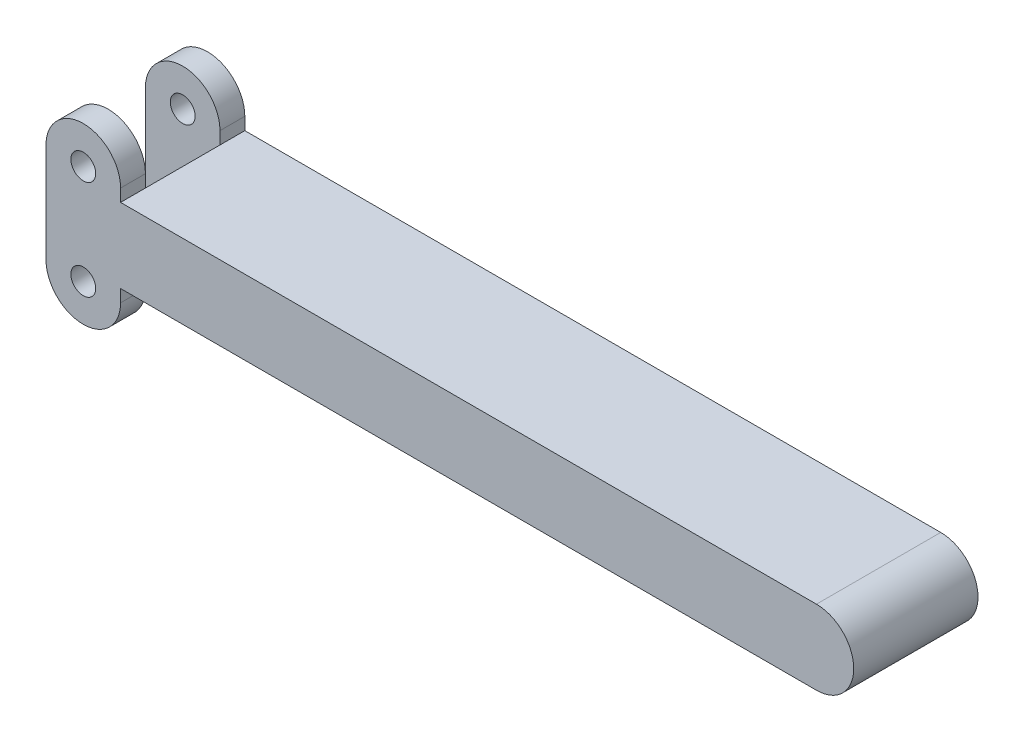
ISO-10303-21;
HEADER;
FILE_DESCRIPTION(('STEP AP214'),'2;1');
FILE_NAME('part.step','',(''),(''),'','','');
FILE_SCHEMA(('AUTOMOTIVE_DESIGN { 1 0 10303 214 1 1 1 1 }'));
ENDSEC;
DATA;
#1=APPLICATION_CONTEXT('core data for automotive mechanical design processes');
#2=APPLICATION_PROTOCOL_DEFINITION('international standard','automotive_design',2000,#1);
#3=PRODUCT_CONTEXT('',#1,'mechanical');
#4=PRODUCT('Part','Part','',(#3));
#5=PRODUCT_RELATED_PRODUCT_CATEGORY('part','',(#4));
#6=PRODUCT_DEFINITION_FORMATION('','',#4);
#7=PRODUCT_DEFINITION_CONTEXT('part definition',#1,'design');
#8=PRODUCT_DEFINITION('design','',#6,#7);
#9=PRODUCT_DEFINITION_SHAPE('','',#8);
#10=(LENGTH_UNIT() NAMED_UNIT(*) SI_UNIT(.MILLI.,.METRE.));
#11=(NAMED_UNIT(*) PLANE_ANGLE_UNIT() SI_UNIT($,.RADIAN.));
#12=(NAMED_UNIT(*) SI_UNIT($,.STERADIAN.) SOLID_ANGLE_UNIT());
#13=UNCERTAINTY_MEASURE_WITH_UNIT(LENGTH_MEASURE(1.E-05),#10,'distance_accuracy_value','');
#14=(GEOMETRIC_REPRESENTATION_CONTEXT(3) GLOBAL_UNCERTAINTY_ASSIGNED_CONTEXT((#13)) GLOBAL_UNIT_ASSIGNED_CONTEXT((#10,
#11,#12)) REPRESENTATION_CONTEXT('',''));
#15=CARTESIAN_POINT('',(0.,0.,0.));
#16=DIRECTION('',(0.,0.,1.));
#17=DIRECTION('',(1.,0.,0.));
#18=AXIS2_PLACEMENT_3D('',#15,#16,#17);
#19=CARTESIAN_POINT('',(9.525,0.,31.75));
#20=DIRECTION('',(-1.,0.,0.));
#21=DIRECTION('',(0.,-1.,0.));
#22=AXIS2_PLACEMENT_3D('',#19,#20,#21);
#23=PLANE('',#22);
#24=DIRECTION('',(0.,-1.,0.));
#25=VECTOR('',#24,1.);
#26=CARTESIAN_POINT('',(9.525,0.,25.4));
#27=LINE('',#26,#25);
#28=CARTESIAN_POINT('',(9.525,25.4,25.4));
#29=VERTEX_POINT('',#28);
#30=CARTESIAN_POINT('',(9.525,22.225,25.4));
#31=VERTEX_POINT('',#30);
#32=EDGE_CURVE('E188',#29,#31,#27,.T.);
#33=ORIENTED_EDGE('',*,*,#32,.F.);
#34=DIRECTION('',(0.,0.,-1.));
#35=VECTOR('',#34,1.);
#36=CARTESIAN_POINT('',(9.525,25.4,31.75));
#37=LINE('',#36,#35);
#38=CARTESIAN_POINT('',(9.525,25.4,31.75));
#39=VERTEX_POINT('',#38);
#40=EDGE_CURVE('E213',#39,#29,#37,.T.);
#41=ORIENTED_EDGE('',*,*,#40,.F.);
#42=DIRECTION('',(0.,1.,0.));
#43=VECTOR('',#42,1.);
#44=CARTESIAN_POINT('',(9.525,0.,31.75));
#45=LINE('',#44,#43);
#46=CARTESIAN_POINT('',(9.525,22.225,31.75));
#47=VERTEX_POINT('',#46);
#48=EDGE_CURVE('E141',#47,#39,#45,.T.);
#49=ORIENTED_EDGE('',*,*,#48,.F.);
#50=DIRECTION('',(0.,0.,-1.));
#51=VECTOR('',#50,1.);
#52=CARTESIAN_POINT('',(9.525,22.225,31.75));
#53=LINE('',#52,#51);
#54=EDGE_CURVE('E44',#47,#31,#53,.T.);
#55=ORIENTED_EDGE('',*,*,#54,.T.);
#56=EDGE_LOOP('',(#33,#41,#49,#55));
#57=FACE_BOUND('',#56,.T.);
#58=ADVANCED_FACE('F35',(#57),#23,.F.);
#59=CARTESIAN_POINT('',(0.,25.4,31.75));
#60=DIRECTION('',(0.,0.,-1.));
#61=DIRECTION('',(-1.,0.,0.));
#62=AXIS2_PLACEMENT_3D('',#59,#60,#61);
#63=CYLINDRICAL_SURFACE('',#62,9.525);
#64=CARTESIAN_POINT('',(0.,25.4,25.4));
#65=DIRECTION('',(0.,0.,-1.));
#66=DIRECTION('',(0.,1.,0.));
#67=AXIS2_PLACEMENT_3D('',#64,#65,#66);
#68=CIRCLE('',#67,9.525);
#69=CARTESIAN_POINT('',(-9.525,25.4,25.4));
#70=VERTEX_POINT('',#69);
#71=EDGE_CURVE('E161',#70,#29,#68,.T.);
#72=ORIENTED_EDGE('',*,*,#71,.F.);
#73=DIRECTION('',(0.,0.,-1.));
#74=VECTOR('',#73,1.);
#75=CARTESIAN_POINT('',(-9.52500000000001,25.4,31.75));
#76=LINE('',#75,#74);
#77=CARTESIAN_POINT('',(-9.52500000000001,25.4,31.75));
#78=VERTEX_POINT('',#77);
#79=EDGE_CURVE('E259',#78,#70,#76,.T.);
#80=ORIENTED_EDGE('',*,*,#79,.F.);
#81=CARTESIAN_POINT('',(0.,25.4,31.75));
#82=DIRECTION('',(0.,0.,1.));
#83=DIRECTION('',(1.,0.,0.));
#84=AXIS2_PLACEMENT_3D('',#81,#82,#83);
#85=CIRCLE('',#84,9.525);
#86=EDGE_CURVE('E146',#39,#78,#85,.T.);
#87=ORIENTED_EDGE('',*,*,#86,.F.);
#88=ORIENTED_EDGE('',*,*,#40,.T.);
#89=EDGE_LOOP('',(#72,#80,#87,#88));
#90=FACE_BOUND('',#89,.T.);
#91=ADVANCED_FACE('F315',(#90),#63,.T.);
#92=CARTESIAN_POINT('',(0.,25.4,6.35));
#93=DIRECTION('',(0.,0.,-1.));
#94=DIRECTION('',(0.,1.,0.));
#95=AXIS2_PLACEMENT_3D('',#92,#93,#94);
#96=CIRCLE('',#95,9.525);
#97=CARTESIAN_POINT('',(-9.525,25.4,6.35));
#98=VERTEX_POINT('',#97);
#99=CARTESIAN_POINT('',(9.525,25.4,6.35));
#100=VERTEX_POINT('',#99);
#101=EDGE_CURVE('E168',#98,#100,#96,.T.);
#102=ORIENTED_EDGE('',*,*,#101,.T.);
#103=CARTESIAN_POINT('',(9.525,25.4,0.));
#104=VERTEX_POINT('',#103);
#105=EDGE_CURVE('E227',#100,#104,#37,.T.);
#106=ORIENTED_EDGE('',*,*,#105,.T.);
#107=CARTESIAN_POINT('',(0.,25.4,0.));
#108=DIRECTION('',(0.,0.,1.));
#109=DIRECTION('',(1.,0.,0.));
#110=AXIS2_PLACEMENT_3D('',#107,#108,#109);
#111=CIRCLE('',#110,9.525);
#112=CARTESIAN_POINT('',(-9.52500000000001,25.4,0.));
#113=VERTEX_POINT('',#112);
#114=EDGE_CURVE('E271',#104,#113,#111,.T.);
#115=ORIENTED_EDGE('',*,*,#114,.T.);
#116=EDGE_CURVE('E258',#98,#113,#76,.T.);
#117=ORIENTED_EDGE('',*,*,#116,.F.);
#118=EDGE_LOOP('',(#102,#106,#115,#117));
#119=FACE_BOUND('',#118,.T.);
#120=ADVANCED_FACE('F272',(#119),#63,.T.);
#121=CARTESIAN_POINT('',(-9.525,0.,31.75));
#122=DIRECTION('',(-1.,0.,0.));
#123=DIRECTION('',(0.,-1.,0.));
#124=AXIS2_PLACEMENT_3D('',#121,#122,#123);
#125=PLANE('',#124);
#126=ORIENTED_EDGE('',*,*,#79,.T.);
#127=DIRECTION('',(0.,-1.,0.));
#128=VECTOR('',#127,1.);
#129=CARTESIAN_POINT('',(-9.525,0.,25.4));
#130=LINE('',#129,#128);
#131=CARTESIAN_POINT('',(-9.525,0.,25.4));
#132=VERTEX_POINT('',#131);
#133=EDGE_CURVE('E182',#70,#132,#130,.T.);
#134=ORIENTED_EDGE('',*,*,#133,.T.);
#135=DIRECTION('',(0.,0.,-1.));
#136=VECTOR('',#135,1.);
#137=CARTESIAN_POINT('',(-9.525,0.,31.75));
#138=LINE('',#137,#136);
#139=CARTESIAN_POINT('',(-9.525,0.,31.75));
#140=VERTEX_POINT('',#139);
#141=EDGE_CURVE('E257',#140,#132,#138,.T.);
#142=ORIENTED_EDGE('',*,*,#141,.F.);
#143=DIRECTION('',(0.,1.,0.));
#144=VECTOR('',#143,1.);
#145=CARTESIAN_POINT('',(-9.525,0.,31.75));
#146=LINE('',#145,#144);
#147=EDGE_CURVE('E122',#140,#78,#146,.T.);
#148=ORIENTED_EDGE('',*,*,#147,.T.);
#149=EDGE_LOOP('',(#126,#134,#142,#148));
#150=FACE_BOUND('',#149,.T.);
#151=ADVANCED_FACE('F341',(#150),#125,.T.);
#152=CARTESIAN_POINT('',(0.,0.,31.75));
#153=DIRECTION('',(0.,0.,-1.));
#154=DIRECTION('',(-1.,0.,0.));
#155=AXIS2_PLACEMENT_3D('',#152,#153,#154);
#156=CYLINDRICAL_SURFACE('',#155,9.525);
#157=CARTESIAN_POINT('',(0.,0.,25.4));
#158=DIRECTION('',(0.,0.,-1.));
#159=DIRECTION('',(0.,1.,0.));
#160=AXIS2_PLACEMENT_3D('',#157,#158,#159);
#161=CIRCLE('',#160,9.525);
#162=CARTESIAN_POINT('',(9.525,0.,25.4));
#163=VERTEX_POINT('',#162);
#164=EDGE_CURVE('E131',#163,#132,#161,.T.);
#165=ORIENTED_EDGE('',*,*,#164,.F.);
#166=DIRECTION('',(0.,0.,-1.));
#167=VECTOR('',#166,1.);
#168=CARTESIAN_POINT('',(9.525,0.,31.75));
#169=LINE('',#168,#167);
#170=CARTESIAN_POINT('',(9.525,0.,31.75));
#171=VERTEX_POINT('',#170);
#172=EDGE_CURVE('E128',#171,#163,#169,.T.);
#173=ORIENTED_EDGE('',*,*,#172,.F.);
#174=CARTESIAN_POINT('',(0.,0.,31.75));
#175=DIRECTION('',(0.,0.,1.));
#176=DIRECTION('',(1.,0.,0.));
#177=AXIS2_PLACEMENT_3D('',#174,#175,#176);
#178=CIRCLE('',#177,9.525);
#179=EDGE_CURVE('E114',#140,#171,#178,.T.);
#180=ORIENTED_EDGE('',*,*,#179,.F.);
#181=ORIENTED_EDGE('',*,*,#141,.T.);
#182=EDGE_LOOP('',(#165,#173,#180,#181));
#183=FACE_BOUND('',#182,.T.);
#184=ADVANCED_FACE('F129',(#183),#156,.T.);
#185=CARTESIAN_POINT('',(9.525,3.175,25.4));
#186=VERTEX_POINT('',#185);
#187=EDGE_CURVE('E181',#186,#163,#27,.T.);
#188=ORIENTED_EDGE('',*,*,#187,.F.);
#189=DIRECTION('',(0.,0.,-1.));
#190=VECTOR('',#189,1.);
#191=CARTESIAN_POINT('',(9.525,3.175,31.75));
#192=LINE('',#191,#190);
#193=CARTESIAN_POINT('',(9.525,3.175,31.75));
#194=VERTEX_POINT('',#193);
#195=EDGE_CURVE('E139',#194,#186,#192,.T.);
#196=ORIENTED_EDGE('',*,*,#195,.F.);
#197=EDGE_CURVE('E119',#171,#194,#45,.T.);
#198=ORIENTED_EDGE('',*,*,#197,.F.);
#199=ORIENTED_EDGE('',*,*,#172,.T.);
#200=EDGE_LOOP('',(#188,#196,#198,#199));
#201=FACE_BOUND('',#200,.T.);
#202=ADVANCED_FACE('F137',(#201),#23,.F.);
#203=CARTESIAN_POINT('',(0.,0.,31.75));
#204=DIRECTION('',(0.,0.,-1.));
#205=DIRECTION('',(-1.,0.,0.));
#206=AXIS2_PLACEMENT_3D('',#203,#204,#205);
#207=CYLINDRICAL_SURFACE('',#206,3.175);
#208=CARTESIAN_POINT('',(0.,0.,31.75));
#209=DIRECTION('',(0.,0.,1.));
#210=DIRECTION('',(1.,0.,0.));
#211=AXIS2_PLACEMENT_3D('',#208,#209,#210);
#212=CIRCLE('',#211,3.175);
#213=CARTESIAN_POINT('',(3.175,0.,31.75));
#214=VERTEX_POINT('',#213);
#215=EDGE_CURVE('E142',#214,#214,#212,.T.);
#216=ORIENTED_EDGE('',*,*,#215,.T.);
#217=EDGE_LOOP('',(#216));
#218=FACE_BOUND('',#217,.T.);
#219=CARTESIAN_POINT('',(0.,0.,25.4));
#220=DIRECTION('',(0.,0.,-1.));
#221=DIRECTION('',(0.,1.,0.));
#222=AXIS2_PLACEMENT_3D('',#219,#220,#221);
#223=CIRCLE('',#222,3.175);
#224=CARTESIAN_POINT('',(0.,3.175,25.4));
#225=VERTEX_POINT('',#224);
#226=EDGE_CURVE('E165',#225,#225,#223,.T.);
#227=ORIENTED_EDGE('',*,*,#226,.T.);
#228=EDGE_LOOP('',(#227));
#229=FACE_BOUND('',#228,.T.);
#230=ADVANCED_FACE('F312',(#218,#229),#207,.F.);
#231=CARTESIAN_POINT('',(0.,25.4,31.75));
#232=DIRECTION('',(0.,0.,-1.));
#233=DIRECTION('',(-1.,0.,0.));
#234=AXIS2_PLACEMENT_3D('',#231,#232,#233);
#235=CYLINDRICAL_SURFACE('',#234,3.175);
#236=CARTESIAN_POINT('',(0.,25.4,31.75));
#237=DIRECTION('',(0.,0.,1.));
#238=DIRECTION('',(1.,0.,0.));
#239=AXIS2_PLACEMENT_3D('',#236,#237,#238);
#240=CIRCLE('',#239,3.175);
#241=CARTESIAN_POINT('',(3.17499999999999,25.4,31.75));
#242=VERTEX_POINT('',#241);
#243=EDGE_CURVE('E353',#242,#242,#240,.T.);
#244=ORIENTED_EDGE('',*,*,#243,.T.);
#245=EDGE_LOOP('',(#244));
#246=FACE_BOUND('',#245,.T.);
#247=CARTESIAN_POINT('',(0.,25.4,25.4));
#248=DIRECTION('',(0.,0.,-1.));
#249=DIRECTION('',(0.,1.,0.));
#250=AXIS2_PLACEMENT_3D('',#247,#248,#249);
#251=CIRCLE('',#250,3.175);
#252=CARTESIAN_POINT('',(0.,28.575,25.4));
#253=VERTEX_POINT('',#252);
#254=EDGE_CURVE('E39',#253,#253,#251,.T.);
#255=ORIENTED_EDGE('',*,*,#254,.T.);
#256=EDGE_LOOP('',(#255));
#257=FACE_BOUND('',#256,.T.);
#258=ADVANCED_FACE('F301',(#246,#257),#235,.F.);
#259=CARTESIAN_POINT('',(187.325,12.7,31.75));
#260=DIRECTION('',(0.,0.,-1.));
#261=DIRECTION('',(-1.,0.,0.));
#262=AXIS2_PLACEMENT_3D('',#259,#260,#261);
#263=CYLINDRICAL_SURFACE('',#262,9.525);
#264=CARTESIAN_POINT('',(187.325,12.7,0.));
#265=DIRECTION('',(0.,0.,1.));
#266=DIRECTION('',(1.,0.,0.));
#267=AXIS2_PLACEMENT_3D('',#264,#265,#266);
#268=CIRCLE('',#267,9.525);
#269=CARTESIAN_POINT('',(187.325,22.225,0.));
#270=VERTEX_POINT('',#269);
#271=CARTESIAN_POINT('',(187.325,3.175,0.));
#272=VERTEX_POINT('',#271);
#273=EDGE_CURVE('E160',#270,#272,#268,.F.);
#274=ORIENTED_EDGE('',*,*,#273,.F.);
#275=DIRECTION('',(0.,0.,-1.));
#276=VECTOR('',#275,1.);
#277=CARTESIAN_POINT('',(187.325,22.225,31.75));
#278=LINE('',#277,#276);
#279=CARTESIAN_POINT('',(187.325,22.225,31.75));
#280=VERTEX_POINT('',#279);
#281=EDGE_CURVE('E11',#280,#270,#278,.T.);
#282=ORIENTED_EDGE('',*,*,#281,.F.);
#283=CARTESIAN_POINT('',(187.325,12.7,31.75));
#284=DIRECTION('',(0.,0.,1.));
#285=DIRECTION('',(1.,0.,0.));
#286=AXIS2_PLACEMENT_3D('',#283,#284,#285);
#287=CIRCLE('',#286,9.525);
#288=CARTESIAN_POINT('',(187.325,3.175,31.75));
#289=VERTEX_POINT('',#288);
#290=EDGE_CURVE('E152',#280,#289,#287,.F.);
#291=ORIENTED_EDGE('',*,*,#290,.T.);
#292=DIRECTION('',(0.,0.,-1.));
#293=VECTOR('',#292,1.);
#294=CARTESIAN_POINT('',(187.325,3.175,31.75));
#295=LINE('',#294,#293);
#296=EDGE_CURVE('E93',#289,#272,#295,.T.);
#297=ORIENTED_EDGE('',*,*,#296,.T.);
#298=EDGE_LOOP('',(#274,#282,#291,#297));
#299=FACE_BOUND('',#298,.T.);
#300=ADVANCED_FACE('F37',(#299),#263,.T.);
#301=CARTESIAN_POINT('',(0.,22.225,31.75));
#302=DIRECTION('',(0.,1.,0.));
#303=DIRECTION('',(0.,0.,1.));
#304=AXIS2_PLACEMENT_3D('',#301,#302,#303);
#305=PLANE('',#304);
#306=DIRECTION('',(1.,0.,0.));
#307=VECTOR('',#306,1.);
#308=CARTESIAN_POINT('',(0.,22.225,0.));
#309=LINE('',#308,#307);
#310=CARTESIAN_POINT('',(9.525,22.225,0.));
#311=VERTEX_POINT('',#310);
#312=EDGE_CURVE('E349',#311,#270,#309,.T.);
#313=ORIENTED_EDGE('',*,*,#312,.F.);
#314=CARTESIAN_POINT('',(9.525,22.225,6.35));
#315=VERTEX_POINT('',#314);
#316=EDGE_CURVE('E211',#315,#311,#53,.T.);
#317=ORIENTED_EDGE('',*,*,#316,.F.);
#318=DIRECTION('',(0.,0.,1.));
#319=VECTOR('',#318,1.);
#320=CARTESIAN_POINT('',(9.525,22.225,31.75));
#321=LINE('',#320,#319);
#322=EDGE_CURVE('E157',#315,#31,#321,.T.);
#323=ORIENTED_EDGE('',*,*,#322,.T.);
#324=ORIENTED_EDGE('',*,*,#54,.F.);
#325=DIRECTION('',(1.,0.,0.));
#326=VECTOR('',#325,1.);
#327=CARTESIAN_POINT('',(0.,22.225,31.75));
#328=LINE('',#327,#326);
#329=EDGE_CURVE('E147',#47,#280,#328,.T.);
#330=ORIENTED_EDGE('',*,*,#329,.T.);
#331=ORIENTED_EDGE('',*,*,#281,.T.);
#332=EDGE_LOOP('',(#313,#317,#323,#324,#330,#331));
#333=FACE_BOUND('',#332,.T.);
#334=ADVANCED_FACE('F209',(#333),#305,.T.);
#335=ORIENTED_EDGE('',*,*,#105,.F.);
#336=DIRECTION('',(0.,-1.,0.));
#337=VECTOR('',#336,1.);
#338=CARTESIAN_POINT('',(9.525,0.,6.35));
#339=LINE('',#338,#337);
#340=EDGE_CURVE('E189',#100,#315,#339,.T.);
#341=ORIENTED_EDGE('',*,*,#340,.T.);
#342=ORIENTED_EDGE('',*,*,#316,.T.);
#343=DIRECTION('',(0.,1.,0.));
#344=VECTOR('',#343,1.);
#345=CARTESIAN_POINT('',(9.525,0.,0.));
#346=LINE('',#345,#344);
#347=EDGE_CURVE('E274',#311,#104,#346,.T.);
#348=ORIENTED_EDGE('',*,*,#347,.T.);
#349=EDGE_LOOP('',(#335,#341,#342,#348));
#350=FACE_BOUND('',#349,.T.);
#351=ADVANCED_FACE('F223',(#350),#23,.F.);
#352=DIRECTION('',(0.,-1.,0.));
#353=VECTOR('',#352,1.);
#354=CARTESIAN_POINT('',(-9.525,0.,6.35));
#355=LINE('',#354,#353);
#356=CARTESIAN_POINT('',(-9.525,0.,6.35));
#357=VERTEX_POINT('',#356);
#358=EDGE_CURVE('E178',#98,#357,#355,.T.);
#359=ORIENTED_EDGE('',*,*,#358,.F.);
#360=ORIENTED_EDGE('',*,*,#116,.T.);
#361=DIRECTION('',(0.,1.,0.));
#362=VECTOR('',#361,1.);
#363=CARTESIAN_POINT('',(-9.525,0.,0.));
#364=LINE('',#363,#362);
#365=CARTESIAN_POINT('',(-9.525,0.,0.));
#366=VERTEX_POINT('',#365);
#367=EDGE_CURVE('E269',#366,#113,#364,.T.);
#368=ORIENTED_EDGE('',*,*,#367,.F.);
#369=EDGE_CURVE('E134',#357,#366,#138,.T.);
#370=ORIENTED_EDGE('',*,*,#369,.F.);
#371=EDGE_LOOP('',(#359,#360,#368,#370));
#372=FACE_BOUND('',#371,.T.);
#373=ADVANCED_FACE('F266',(#372),#125,.T.);
#374=CARTESIAN_POINT('',(9.525,0.,6.35));
#375=VERTEX_POINT('',#374);
#376=CARTESIAN_POINT('',(9.525,0.,0.));
#377=VERTEX_POINT('',#376);
#378=EDGE_CURVE('E135',#375,#377,#169,.T.);
#379=ORIENTED_EDGE('',*,*,#378,.F.);
#380=CARTESIAN_POINT('',(0.,0.,6.35));
#381=DIRECTION('',(0.,0.,-1.));
#382=DIRECTION('',(0.,1.,0.));
#383=AXIS2_PLACEMENT_3D('',#380,#381,#382);
#384=CIRCLE('',#383,9.525);
#385=EDGE_CURVE('E171',#375,#357,#384,.T.);
#386=ORIENTED_EDGE('',*,*,#385,.T.);
#387=ORIENTED_EDGE('',*,*,#369,.T.);
#388=CARTESIAN_POINT('',(0.,0.,0.));
#389=DIRECTION('',(0.,0.,1.));
#390=DIRECTION('',(1.,0.,0.));
#391=AXIS2_PLACEMENT_3D('',#388,#389,#390);
#392=CIRCLE('',#391,9.525);
#393=EDGE_CURVE('E282',#366,#377,#392,.T.);
#394=ORIENTED_EDGE('',*,*,#393,.T.);
#395=EDGE_LOOP('',(#379,#386,#387,#394));
#396=FACE_BOUND('',#395,.T.);
#397=ADVANCED_FACE('F326',(#396),#156,.T.);
#398=CARTESIAN_POINT('',(9.525,3.175,6.35));
#399=VERTEX_POINT('',#398);
#400=CARTESIAN_POINT('',(9.525,3.175,0.));
#401=VERTEX_POINT('',#400);
#402=EDGE_CURVE('E252',#399,#401,#192,.T.);
#403=ORIENTED_EDGE('',*,*,#402,.F.);
#404=EDGE_CURVE('E185',#399,#375,#339,.T.);
#405=ORIENTED_EDGE('',*,*,#404,.T.);
#406=ORIENTED_EDGE('',*,*,#378,.T.);
#407=EDGE_CURVE('E284',#377,#401,#346,.T.);
#408=ORIENTED_EDGE('',*,*,#407,.T.);
#409=EDGE_LOOP('',(#403,#405,#406,#408));
#410=FACE_BOUND('',#409,.T.);
#411=ADVANCED_FACE('F317',(#410),#23,.F.);
#412=CARTESIAN_POINT('',(0.,0.,6.35));
#413=DIRECTION('',(0.,0.,-1.));
#414=DIRECTION('',(0.,1.,0.));
#415=AXIS2_PLACEMENT_3D('',#412,#413,#414);
#416=CIRCLE('',#415,3.175);
#417=CARTESIAN_POINT('',(0.,3.175,6.35));
#418=VERTEX_POINT('',#417);
#419=EDGE_CURVE('E174',#418,#418,#416,.T.);
#420=ORIENTED_EDGE('',*,*,#419,.F.);
#421=EDGE_LOOP('',(#420));
#422=FACE_BOUND('',#421,.T.);
#423=CARTESIAN_POINT('',(0.,0.,0.));
#424=DIRECTION('',(0.,0.,1.));
#425=DIRECTION('',(1.,0.,0.));
#426=AXIS2_PLACEMENT_3D('',#423,#424,#425);
#427=CIRCLE('',#426,3.175);
#428=CARTESIAN_POINT('',(3.175,0.,0.));
#429=VERTEX_POINT('',#428);
#430=EDGE_CURVE('E290',#429,#429,#427,.T.);
#431=ORIENTED_EDGE('',*,*,#430,.F.);
#432=EDGE_LOOP('',(#431));
#433=FACE_BOUND('',#432,.T.);
#434=ADVANCED_FACE('F307',(#422,#433),#207,.F.);
#435=CARTESIAN_POINT('',(0.,3.175,31.75));
#436=DIRECTION('',(0.,1.,0.));
#437=DIRECTION('',(0.,0.,1.));
#438=AXIS2_PLACEMENT_3D('',#435,#436,#437);
#439=PLANE('',#438);
#440=DIRECTION('',(1.,0.,0.));
#441=VECTOR('',#440,1.);
#442=CARTESIAN_POINT('',(0.,3.175,0.));
#443=LINE('',#442,#441);
#444=EDGE_CURVE('E288',#401,#272,#443,.T.);
#445=ORIENTED_EDGE('',*,*,#444,.T.);
#446=ORIENTED_EDGE('',*,*,#296,.F.);
#447=DIRECTION('',(1.,0.,0.));
#448=VECTOR('',#447,1.);
#449=CARTESIAN_POINT('',(0.,3.175,31.75));
#450=LINE('',#449,#448);
#451=EDGE_CURVE('E61',#194,#289,#450,.T.);
#452=ORIENTED_EDGE('',*,*,#451,.F.);
#453=ORIENTED_EDGE('',*,*,#195,.T.);
#454=EDGE_CURVE('E249',#186,#399,#192,.T.);
#455=ORIENTED_EDGE('',*,*,#454,.T.);
#456=ORIENTED_EDGE('',*,*,#402,.T.);
#457=EDGE_LOOP('',(#445,#446,#452,#453,#455,#456));
#458=FACE_BOUND('',#457,.T.);
#459=ADVANCED_FACE('F298',(#458),#439,.F.);
#460=CARTESIAN_POINT('',(0.,25.4,6.35));
#461=DIRECTION('',(0.,0.,-1.));
#462=DIRECTION('',(0.,1.,0.));
#463=AXIS2_PLACEMENT_3D('',#460,#461,#462);
#464=CIRCLE('',#463,3.175);
#465=CARTESIAN_POINT('',(0.,28.575,6.35));
#466=VERTEX_POINT('',#465);
#467=EDGE_CURVE('E177',#466,#466,#464,.T.);
#468=ORIENTED_EDGE('',*,*,#467,.F.);
#469=EDGE_LOOP('',(#468));
#470=FACE_BOUND('',#469,.T.);
#471=CARTESIAN_POINT('',(0.,25.4,0.));
#472=DIRECTION('',(0.,0.,1.));
#473=DIRECTION('',(1.,0.,0.));
#474=AXIS2_PLACEMENT_3D('',#471,#472,#473);
#475=CIRCLE('',#474,3.175);
#476=CARTESIAN_POINT('',(3.17499999999999,25.4,0.));
#477=VERTEX_POINT('',#476);
#478=EDGE_CURVE('E154',#477,#477,#475,.T.);
#479=ORIENTED_EDGE('',*,*,#478,.F.);
#480=EDGE_LOOP('',(#479));
#481=FACE_BOUND('',#480,.T.);
#482=ADVANCED_FACE('F296',(#470,#481),#235,.F.);
#483=CARTESIAN_POINT('',(0.,0.,31.75));
#484=DIRECTION('',(0.,0.,1.));
#485=DIRECTION('',(1.,0.,0.));
#486=AXIS2_PLACEMENT_3D('',#483,#484,#485);
#487=PLANE('',#486);
#488=ORIENTED_EDGE('',*,*,#290,.F.);
#489=ORIENTED_EDGE('',*,*,#329,.F.);
#490=ORIENTED_EDGE('',*,*,#48,.T.);
#491=ORIENTED_EDGE('',*,*,#86,.T.);
#492=ORIENTED_EDGE('',*,*,#147,.F.);
#493=ORIENTED_EDGE('',*,*,#179,.T.);
#494=ORIENTED_EDGE('',*,*,#197,.T.);
#495=ORIENTED_EDGE('',*,*,#451,.T.);
#496=EDGE_LOOP('',(#488,#489,#490,#491,#492,#493,#494,#495));
#497=FACE_BOUND('',#496,.T.);
#498=ORIENTED_EDGE('',*,*,#215,.F.);
#499=EDGE_LOOP('',(#498));
#500=FACE_BOUND('',#499,.T.);
#501=ORIENTED_EDGE('',*,*,#243,.F.);
#502=EDGE_LOOP('',(#501));
#503=FACE_BOUND('',#502,.T.);
#504=ADVANCED_FACE('F116',(#497,#500,#503),#487,.T.);
#505=CARTESIAN_POINT('',(0.,0.,0.));
#506=DIRECTION('',(0.,0.,1.));
#507=DIRECTION('',(1.,0.,0.));
#508=AXIS2_PLACEMENT_3D('',#505,#506,#507);
#509=PLANE('',#508);
#510=ORIENTED_EDGE('',*,*,#273,.T.);
#511=ORIENTED_EDGE('',*,*,#444,.F.);
#512=ORIENTED_EDGE('',*,*,#407,.F.);
#513=ORIENTED_EDGE('',*,*,#393,.F.);
#514=ORIENTED_EDGE('',*,*,#367,.T.);
#515=ORIENTED_EDGE('',*,*,#114,.F.);
#516=ORIENTED_EDGE('',*,*,#347,.F.);
#517=ORIENTED_EDGE('',*,*,#312,.T.);
#518=EDGE_LOOP('',(#510,#511,#512,#513,#514,#515,#516,#517));
#519=FACE_BOUND('',#518,.T.);
#520=ORIENTED_EDGE('',*,*,#430,.T.);
#521=EDGE_LOOP('',(#520));
#522=FACE_BOUND('',#521,.T.);
#523=ORIENTED_EDGE('',*,*,#478,.T.);
#524=EDGE_LOOP('',(#523));
#525=FACE_BOUND('',#524,.T.);
#526=ADVANCED_FACE('F278',(#519,#522,#525),#509,.F.);
#527=CARTESIAN_POINT('',(9.525,0.,0.));
#528=DIRECTION('',(-1.,0.,0.));
#529=DIRECTION('',(0.,0.,1.));
#530=AXIS2_PLACEMENT_3D('',#527,#528,#529);
#531=PLANE('',#530);
#532=EDGE_CURVE('E52',#315,#399,#339,.T.);
#533=ORIENTED_EDGE('',*,*,#532,.T.);
#534=ORIENTED_EDGE('',*,*,#454,.F.);
#535=EDGE_CURVE('E191',#31,#186,#27,.T.);
#536=ORIENTED_EDGE('',*,*,#535,.F.);
#537=ORIENTED_EDGE('',*,*,#322,.F.);
#538=EDGE_LOOP('',(#533,#534,#536,#537));
#539=FACE_BOUND('',#538,.T.);
#540=ADVANCED_FACE('F250',(#539),#531,.T.);
#541=CARTESIAN_POINT('',(9.525,0.,25.4));
#542=DIRECTION('',(0.,0.,-1.));
#543=DIRECTION('',(0.,1.,0.));
#544=AXIS2_PLACEMENT_3D('',#541,#542,#543);
#545=PLANE('',#544);
#546=ORIENTED_EDGE('',*,*,#226,.F.);
#547=EDGE_LOOP('',(#546));
#548=FACE_BOUND('',#547,.T.);
#549=ORIENTED_EDGE('',*,*,#254,.F.);
#550=EDGE_LOOP('',(#549));
#551=FACE_BOUND('',#550,.T.);
#552=ORIENTED_EDGE('',*,*,#71,.T.);
#553=ORIENTED_EDGE('',*,*,#32,.T.);
#554=ORIENTED_EDGE('',*,*,#535,.T.);
#555=ORIENTED_EDGE('',*,*,#187,.T.);
#556=ORIENTED_EDGE('',*,*,#164,.T.);
#557=ORIENTED_EDGE('',*,*,#133,.F.);
#558=EDGE_LOOP('',(#552,#553,#554,#555,#556,#557));
#559=FACE_BOUND('',#558,.T.);
#560=ADVANCED_FACE('F197',(#548,#551,#559),#545,.T.);
#561=CARTESIAN_POINT('',(9.525,0.,6.35));
#562=DIRECTION('',(0.,0.,-1.));
#563=DIRECTION('',(0.,1.,0.));
#564=AXIS2_PLACEMENT_3D('',#561,#562,#563);
#565=PLANE('',#564);
#566=ORIENTED_EDGE('',*,*,#419,.T.);
#567=EDGE_LOOP('',(#566));
#568=FACE_BOUND('',#567,.T.);
#569=ORIENTED_EDGE('',*,*,#467,.T.);
#570=EDGE_LOOP('',(#569));
#571=FACE_BOUND('',#570,.T.);
#572=ORIENTED_EDGE('',*,*,#101,.F.);
#573=ORIENTED_EDGE('',*,*,#358,.T.);
#574=ORIENTED_EDGE('',*,*,#385,.F.);
#575=ORIENTED_EDGE('',*,*,#404,.F.);
#576=ORIENTED_EDGE('',*,*,#532,.F.);
#577=ORIENTED_EDGE('',*,*,#340,.F.);
#578=EDGE_LOOP('',(#572,#573,#574,#575,#576,#577));
#579=FACE_BOUND('',#578,.T.);
#580=ADVANCED_FACE('F232',(#568,#571,#579),#565,.F.);
#581=CLOSED_SHELL('',(#58,#91,#120,#151,#184,#202,#230,#258,#300,#334,#351,#373,#397,#411,#434,
#459,#482,#504,#526,#540,#560,#580));
#582=MANIFOLD_SOLID_BREP('B2',#581);
#583=ADVANCED_BREP_SHAPE_REPRESENTATION('',(#18,#582),#14);
#584=SHAPE_DEFINITION_REPRESENTATION(#9,#583);
ENDSEC;
END-ISO-10303-21;
